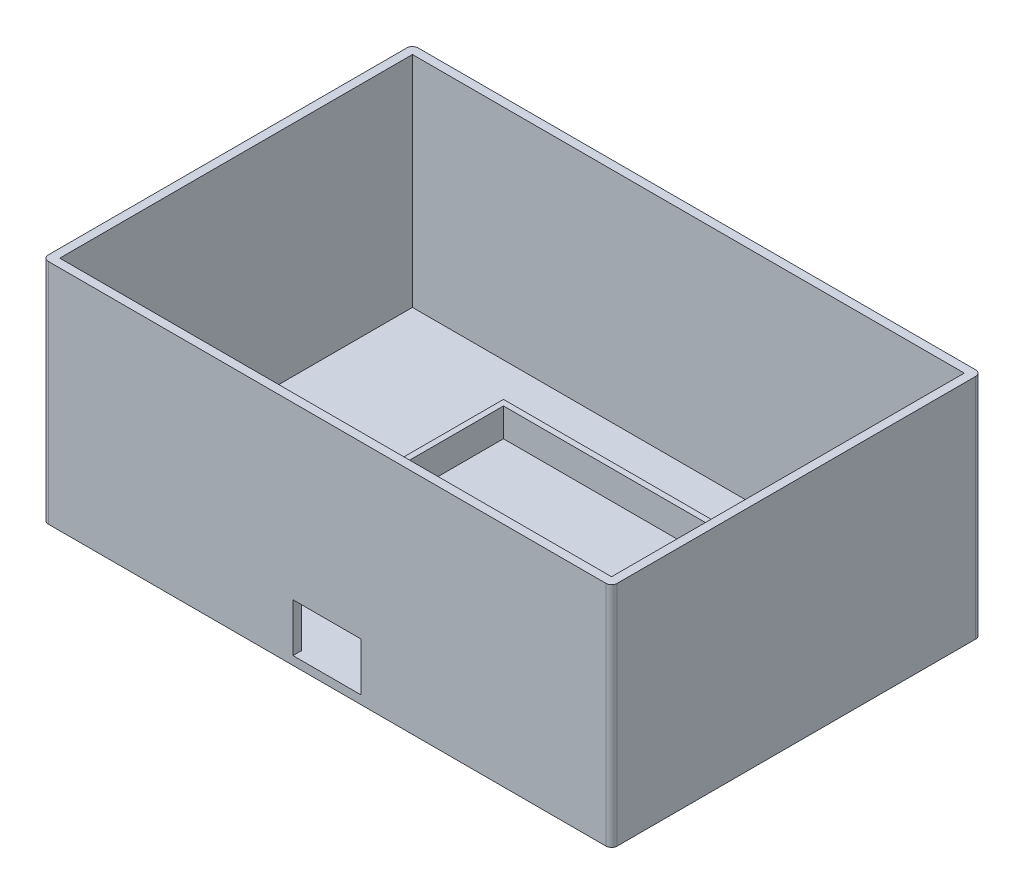
ISO-10303-21;
HEADER;
FILE_DESCRIPTION(('STEP AP214'),'2;1');
FILE_NAME('part.step','',(''),(''),'','','');
FILE_SCHEMA(('AUTOMOTIVE_DESIGN { 1 0 10303 214 1 1 1 1 }'));
ENDSEC;
DATA;
#1=APPLICATION_CONTEXT('core data for automotive mechanical design processes');
#2=APPLICATION_PROTOCOL_DEFINITION('international standard','automotive_design',2000,#1);
#3=PRODUCT_CONTEXT('',#1,'mechanical');
#4=PRODUCT('Part','Part','',(#3));
#5=PRODUCT_RELATED_PRODUCT_CATEGORY('part','',(#4));
#6=PRODUCT_DEFINITION_FORMATION('','',#4);
#7=PRODUCT_DEFINITION_CONTEXT('part definition',#1,'design');
#8=PRODUCT_DEFINITION('design','',#6,#7);
#9=PRODUCT_DEFINITION_SHAPE('','',#8);
#10=(LENGTH_UNIT() NAMED_UNIT(*) SI_UNIT(.MILLI.,.METRE.));
#11=(NAMED_UNIT(*) PLANE_ANGLE_UNIT() SI_UNIT($,.RADIAN.));
#12=(NAMED_UNIT(*) SI_UNIT($,.STERADIAN.) SOLID_ANGLE_UNIT());
#13=UNCERTAINTY_MEASURE_WITH_UNIT(LENGTH_MEASURE(1.E-05),#10,'distance_accuracy_value','');
#14=(GEOMETRIC_REPRESENTATION_CONTEXT(3) GLOBAL_UNCERTAINTY_ASSIGNED_CONTEXT((#13)) GLOBAL_UNIT_ASSIGNED_CONTEXT((#10,
#11,#12)) REPRESENTATION_CONTEXT('',''));
#15=CARTESIAN_POINT('',(0.,0.,0.));
#16=DIRECTION('',(0.,0.,1.));
#17=DIRECTION('',(1.,0.,0.));
#18=AXIS2_PLACEMENT_3D('',#15,#16,#17);
#19=CARTESIAN_POINT('',(0.,1.5,0.));
#20=DIRECTION('',(0.,1.,0.));
#21=DIRECTION('',(0.,0.,1.));
#22=AXIS2_PLACEMENT_3D('',#19,#20,#21);
#23=PLANE('',#22);
#24=DIRECTION('',(1.,0.,0.));
#25=VECTOR('',#24,1.);
#26=CARTESIAN_POINT('',(-47.2604562737643,1.5,20.6444866920152));
#27=LINE('',#26,#25);
#28=CARTESIAN_POINT('',(-47.2604562737643,1.5,20.6444866920152));
#29=VERTEX_POINT('',#28);
#30=CARTESIAN_POINT('',(-20.2604562737643,1.5,20.6444866920152));
#31=VERTEX_POINT('',#30);
#32=EDGE_CURVE('E288',#29,#31,#27,.T.);
#33=ORIENTED_EDGE('',*,*,#32,.T.);
#34=DIRECTION('',(0.,0.,1.));
#35=VECTOR('',#34,1.);
#36=CARTESIAN_POINT('',(-20.2604562737643,1.5,20.6444866920152));
#37=LINE('',#36,#35);
#38=CARTESIAN_POINT('',(-20.2604562737643,1.5,-30.3555133079848));
#39=VERTEX_POINT('',#38);
#40=EDGE_CURVE('E250',#39,#31,#37,.T.);
#41=ORIENTED_EDGE('',*,*,#40,.F.);
#42=DIRECTION('',(-1.,0.,0.));
#43=VECTOR('',#42,1.);
#44=CARTESIAN_POINT('',(-20.2604562737643,1.5,-30.3555133079848));
#45=LINE('',#44,#43);
#46=CARTESIAN_POINT('',(22.7395437262358,1.5,-30.3555133079848));
#47=VERTEX_POINT('',#46);
#48=EDGE_CURVE('E253',#47,#39,#45,.T.);
#49=ORIENTED_EDGE('',*,*,#48,.F.);
#50=DIRECTION('',(0.,0.,-1.));
#51=VECTOR('',#50,1.);
#52=CARTESIAN_POINT('',(22.7395437262358,1.5,20.6444866920152));
#53=LINE('',#52,#51);
#54=CARTESIAN_POINT('',(22.7395437262358,1.5,20.6444866920152));
#55=VERTEX_POINT('',#54);
#56=EDGE_CURVE('E262',#55,#47,#53,.T.);
#57=ORIENTED_EDGE('',*,*,#56,.F.);
#58=CARTESIAN_POINT('',(49.7395437262358,1.5,20.6444866920152));
#59=VERTEX_POINT('',#58);
#60=EDGE_CURVE('E286',#55,#59,#27,.T.);
#61=ORIENTED_EDGE('',*,*,#60,.T.);
#62=DIRECTION('',(0.,0.,-1.));
#63=VECTOR('',#62,1.);
#64=CARTESIAN_POINT('',(49.7395437262358,1.5,-41.3555133079848));
#65=LINE('',#64,#63);
#66=CARTESIAN_POINT('',(49.7395437262358,1.5,-41.3555133079848));
#67=VERTEX_POINT('',#66);
#68=EDGE_CURVE('E291',#59,#67,#65,.T.);
#69=ORIENTED_EDGE('',*,*,#68,.T.);
#70=DIRECTION('',(-1.,0.,0.));
#71=VECTOR('',#70,1.);
#72=CARTESIAN_POINT('',(-47.2604562737643,1.5,-41.3555133079848));
#73=LINE('',#72,#71);
#74=CARTESIAN_POINT('',(-47.2604562737643,1.5,-41.3555133079848));
#75=VERTEX_POINT('',#74);
#76=EDGE_CURVE('E294',#67,#75,#73,.T.);
#77=ORIENTED_EDGE('',*,*,#76,.T.);
#78=DIRECTION('',(0.,0.,1.));
#79=VECTOR('',#78,1.);
#80=CARTESIAN_POINT('',(-47.2604562737643,1.5,-41.3555133079848));
#81=LINE('',#80,#79);
#82=EDGE_CURVE('E283',#75,#29,#81,.T.);
#83=ORIENTED_EDGE('',*,*,#82,.T.);
#84=EDGE_LOOP('',(#33,#41,#49,#57,#61,#69,#77,#83));
#85=FACE_BOUND('',#84,.T.);
#86=ADVANCED_FACE('F32',(#85),#23,.T.);
#87=CARTESIAN_POINT('',(0.,40.,0.));
#88=DIRECTION('',(0.,1.,0.));
#89=DIRECTION('',(0.,0.,1.));
#90=AXIS2_PLACEMENT_3D('',#87,#88,#89);
#91=PLANE('',#90);
#92=DIRECTION('',(0.,0.,1.));
#93=VECTOR('',#92,1.);
#94=CARTESIAN_POINT('',(-47.2604562737643,40.,-41.3555133079848));
#95=LINE('',#94,#93);
#96=CARTESIAN_POINT('',(-47.2604562737643,40.,-41.3555133079848));
#97=VERTEX_POINT('',#96);
#98=CARTESIAN_POINT('',(-47.2604562737643,40.,20.6444866920152));
#99=VERTEX_POINT('',#98);
#100=EDGE_CURVE('E281',#97,#99,#95,.T.);
#101=ORIENTED_EDGE('',*,*,#100,.F.);
#102=DIRECTION('',(-1.,0.,0.));
#103=VECTOR('',#102,1.);
#104=CARTESIAN_POINT('',(-47.2604562737643,40.,-41.3555133079848));
#105=LINE('',#104,#103);
#106=CARTESIAN_POINT('',(49.7395437262358,40.,-41.3555133079848));
#107=VERTEX_POINT('',#106);
#108=EDGE_CURVE('E287',#107,#97,#105,.T.);
#109=ORIENTED_EDGE('',*,*,#108,.F.);
#110=DIRECTION('',(0.,0.,-1.));
#111=VECTOR('',#110,1.);
#112=CARTESIAN_POINT('',(49.7395437262358,40.,-41.3555133079848));
#113=LINE('',#112,#111);
#114=CARTESIAN_POINT('',(49.7395437262358,40.,20.6444866920152));
#115=VERTEX_POINT('',#114);
#116=EDGE_CURVE('E302',#115,#107,#113,.T.);
#117=ORIENTED_EDGE('',*,*,#116,.F.);
#118=DIRECTION('',(1.,0.,0.));
#119=VECTOR('',#118,1.);
#120=CARTESIAN_POINT('',(-47.2604562737643,40.,20.6444866920152));
#121=LINE('',#120,#119);
#122=EDGE_CURVE('E299',#99,#115,#121,.T.);
#123=ORIENTED_EDGE('',*,*,#122,.F.);
#124=EDGE_LOOP('',(#101,#109,#117,#123));
#125=FACE_BOUND('',#124,.T.);
#126=DIRECTION('',(-1.,0.,0.));
#127=VECTOR('',#126,1.);
#128=CARTESIAN_POINT('',(-48.7604562737643,40.,-42.8555133079848));
#129=LINE('',#128,#127);
#130=CARTESIAN_POINT('',(50.2395437262357,40.,-42.8555133079848));
#131=VERTEX_POINT('',#130);
#132=CARTESIAN_POINT('',(-47.7604562737643,40.,-42.8555133079848));
#133=VERTEX_POINT('',#132);
#134=EDGE_CURVE('E309',#131,#133,#129,.T.);
#135=ORIENTED_EDGE('',*,*,#134,.T.);
#136=CARTESIAN_POINT('',(-47.7604562737643,40.,-41.8555133079848));
#137=DIRECTION('',(0.,1.,0.));
#138=DIRECTION('',(0.,0.,1.));
#139=AXIS2_PLACEMENT_3D('',#136,#137,#138);
#140=CIRCLE('',#139,1.);
#141=CARTESIAN_POINT('',(-48.7604562737643,40.,-41.8555133079848));
#142=VERTEX_POINT('',#141);
#143=EDGE_CURVE('E370',#133,#142,#140,.T.);
#144=ORIENTED_EDGE('',*,*,#143,.T.);
#145=DIRECTION('',(0.,0.,1.));
#146=VECTOR('',#145,1.);
#147=CARTESIAN_POINT('',(-48.7604562737643,40.,-42.8555133079848));
#148=LINE('',#147,#146);
#149=CARTESIAN_POINT('',(-48.7604562737643,40.,21.1444866920152));
#150=VERTEX_POINT('',#149);
#151=EDGE_CURVE('E320',#142,#150,#148,.T.);
#152=ORIENTED_EDGE('',*,*,#151,.T.);
#153=CARTESIAN_POINT('',(-47.7604562737643,40.,21.1444866920152));
#154=DIRECTION('',(0.,1.,0.));
#155=DIRECTION('',(0.,0.,1.));
#156=AXIS2_PLACEMENT_3D('',#153,#154,#155);
#157=CIRCLE('',#156,1.);
#158=CARTESIAN_POINT('',(-47.7604562737643,40.,22.1444866920152));
#159=VERTEX_POINT('',#158);
#160=EDGE_CURVE('E364',#150,#159,#157,.T.);
#161=ORIENTED_EDGE('',*,*,#160,.T.);
#162=DIRECTION('',(1.,0.,0.));
#163=VECTOR('',#162,1.);
#164=CARTESIAN_POINT('',(-48.7604562737643,40.,22.1444866920152));
#165=LINE('',#164,#163);
#166=CARTESIAN_POINT('',(50.2395437262358,40.,22.1444866920152));
#167=VERTEX_POINT('',#166);
#168=EDGE_CURVE('E332',#159,#167,#165,.T.);
#169=ORIENTED_EDGE('',*,*,#168,.T.);
#170=CARTESIAN_POINT('',(50.2395437262358,40.,21.1444866920152));
#171=DIRECTION('',(0.,1.,0.));
#172=DIRECTION('',(0.,0.,1.));
#173=AXIS2_PLACEMENT_3D('',#170,#171,#172);
#174=CIRCLE('',#173,1.);
#175=CARTESIAN_POINT('',(51.2395437262358,40.,21.1444866920152));
#176=VERTEX_POINT('',#175);
#177=EDGE_CURVE('E366',#167,#176,#174,.T.);
#178=ORIENTED_EDGE('',*,*,#177,.T.);
#179=DIRECTION('',(0.,0.,-1.));
#180=VECTOR('',#179,1.);
#181=CARTESIAN_POINT('',(51.2395437262357,40.,-42.8555133079848));
#182=LINE('',#181,#180);
#183=CARTESIAN_POINT('',(51.2395437262357,40.,-41.8555133079848));
#184=VERTEX_POINT('',#183);
#185=EDGE_CURVE('E335',#176,#184,#182,.T.);
#186=ORIENTED_EDGE('',*,*,#185,.T.);
#187=CARTESIAN_POINT('',(50.2395437262357,40.,-41.8555133079848));
#188=DIRECTION('',(0.,1.,0.));
#189=DIRECTION('',(0.,0.,1.));
#190=AXIS2_PLACEMENT_3D('',#187,#188,#189);
#191=CIRCLE('',#190,1.);
#192=EDGE_CURVE('E368',#184,#131,#191,.T.);
#193=ORIENTED_EDGE('',*,*,#192,.T.);
#194=EDGE_LOOP('',(#135,#144,#152,#161,#169,#178,#186,#193));
#195=FACE_BOUND('',#194,.T.);
#196=ADVANCED_FACE('F397',(#125,#195),#91,.T.);
#197=CARTESIAN_POINT('',(-48.7604562737643,80.,-42.8555133079848));
#198=DIRECTION('',(1.,0.,0.));
#199=DIRECTION('',(0.,0.,-1.));
#200=AXIS2_PLACEMENT_3D('',#197,#198,#199);
#201=PLANE('',#200);
#202=ORIENTED_EDGE('',*,*,#151,.F.);
#203=DIRECTION('',(0.,-1.,0.));
#204=VECTOR('',#203,1.);
#205=CARTESIAN_POINT('',(-48.7604562737643,80.,-41.8555133079848));
#206=LINE('',#205,#204);
#207=CARTESIAN_POINT('',(-48.7604562737643,0.,-41.8555133079848));
#208=VERTEX_POINT('',#207);
#209=EDGE_CURVE('E348',#142,#208,#206,.T.);
#210=ORIENTED_EDGE('',*,*,#209,.T.);
#211=DIRECTION('',(0.,0.,1.));
#212=VECTOR('',#211,1.);
#213=CARTESIAN_POINT('',(-48.7604562737643,0.,-42.8555133079848));
#214=LINE('',#213,#212);
#215=CARTESIAN_POINT('',(-48.7604562737643,0.,21.1444866920152));
#216=VERTEX_POINT('',#215);
#217=EDGE_CURVE('E326',#208,#216,#214,.T.);
#218=ORIENTED_EDGE('',*,*,#217,.T.);
#219=DIRECTION('',(0.,-1.,0.));
#220=VECTOR('',#219,1.);
#221=CARTESIAN_POINT('',(-48.7604562737643,80.,21.1444866920152));
#222=LINE('',#221,#220);
#223=EDGE_CURVE('E346',#216,#150,#222,.F.);
#224=ORIENTED_EDGE('',*,*,#223,.T.);
#225=EDGE_LOOP('',(#202,#210,#218,#224));
#226=FACE_BOUND('',#225,.T.);
#227=ADVANCED_FACE('F412',(#226),#201,.F.);
#228=CARTESIAN_POINT('',(-48.7604562737643,80.,22.1444866920152));
#229=DIRECTION('',(0.,0.,-1.));
#230=DIRECTION('',(-1.,0.,0.));
#231=AXIS2_PLACEMENT_3D('',#228,#229,#230);
#232=PLANE('',#231);
#233=DIRECTION('',(1.,0.,0.));
#234=VECTOR('',#233,1.);
#235=CARTESIAN_POINT('',(-4.76045627376426,1.5,22.1444866920152));
#236=LINE('',#235,#234);
#237=CARTESIAN_POINT('',(-4.76045627376426,1.5,22.1444866920152));
#238=VERTEX_POINT('',#237);
#239=CARTESIAN_POINT('',(7.23954372623574,1.5,22.1444866920152));
#240=VERTEX_POINT('',#239);
#241=EDGE_CURVE('E211',#238,#240,#236,.T.);
#242=ORIENTED_EDGE('',*,*,#241,.F.);
#243=DIRECTION('',(0.,-1.,0.));
#244=VECTOR('',#243,1.);
#245=CARTESIAN_POINT('',(-4.76045627376426,2.,22.1444866920152));
#246=LINE('',#245,#244);
#247=CARTESIAN_POINT('',(-4.76045627376426,10.,22.1444866920152));
#248=VERTEX_POINT('',#247);
#249=EDGE_CURVE('E193',#248,#238,#246,.T.);
#250=ORIENTED_EDGE('',*,*,#249,.F.);
#251=DIRECTION('',(-1.,0.,0.));
#252=VECTOR('',#251,1.);
#253=CARTESIAN_POINT('',(-4.76045627376426,10.,22.1444866920152));
#254=LINE('',#253,#252);
#255=CARTESIAN_POINT('',(7.23954372623574,10.,22.1444866920152));
#256=VERTEX_POINT('',#255);
#257=EDGE_CURVE('E277',#256,#248,#254,.T.);
#258=ORIENTED_EDGE('',*,*,#257,.F.);
#259=DIRECTION('',(0.,1.,0.));
#260=VECTOR('',#259,1.);
#261=CARTESIAN_POINT('',(7.23954372623574,2.,22.1444866920152));
#262=LINE('',#261,#260);
#263=EDGE_CURVE('E204',#240,#256,#262,.T.);
#264=ORIENTED_EDGE('',*,*,#263,.F.);
#265=EDGE_LOOP('',(#242,#250,#258,#264));
#266=FACE_BOUND('',#265,.T.);
#267=DIRECTION('',(1.,0.,0.));
#268=VECTOR('',#267,1.);
#269=CARTESIAN_POINT('',(-48.7604562737643,0.,22.1444866920152));
#270=LINE('',#269,#268);
#271=CARTESIAN_POINT('',(-47.7604562737643,0.,22.1444866920152));
#272=VERTEX_POINT('',#271);
#273=CARTESIAN_POINT('',(50.2395437262358,0.,22.1444866920152));
#274=VERTEX_POINT('',#273);
#275=EDGE_CURVE('E323',#272,#274,#270,.T.);
#276=ORIENTED_EDGE('',*,*,#275,.T.);
#277=DIRECTION('',(0.,-1.,0.));
#278=VECTOR('',#277,1.);
#279=CARTESIAN_POINT('',(50.2395437262358,80.,22.1444866920152));
#280=LINE('',#279,#278);
#281=EDGE_CURVE('E11',#274,#167,#280,.F.);
#282=ORIENTED_EDGE('',*,*,#281,.T.);
#283=ORIENTED_EDGE('',*,*,#168,.F.);
#284=DIRECTION('',(0.,-1.,0.));
#285=VECTOR('',#284,1.);
#286=CARTESIAN_POINT('',(-47.7604562737643,80.,22.1444866920152));
#287=LINE('',#286,#285);
#288=EDGE_CURVE('E40',#159,#272,#287,.T.);
#289=ORIENTED_EDGE('',*,*,#288,.T.);
#290=EDGE_LOOP('',(#276,#282,#283,#289));
#291=FACE_BOUND('',#290,.T.);
#292=ADVANCED_FACE('F216',(#266,#291),#232,.F.);
#293=CARTESIAN_POINT('',(51.2395437262357,80.,-42.8555133079848));
#294=DIRECTION('',(-1.,0.,0.));
#295=DIRECTION('',(0.,0.,1.));
#296=AXIS2_PLACEMENT_3D('',#293,#294,#295);
#297=PLANE('',#296);
#298=DIRECTION('',(0.,0.,-1.));
#299=VECTOR('',#298,1.);
#300=CARTESIAN_POINT('',(51.2395437262357,0.,-42.8555133079848));
#301=LINE('',#300,#299);
#302=CARTESIAN_POINT('',(51.2395437262358,0.,21.1444866920152));
#303=VERTEX_POINT('',#302);
#304=CARTESIAN_POINT('',(51.2395437262357,0.,-41.8555133079848));
#305=VERTEX_POINT('',#304);
#306=EDGE_CURVE('E319',#303,#305,#301,.T.);
#307=ORIENTED_EDGE('',*,*,#306,.T.);
#308=DIRECTION('',(0.,-1.,0.));
#309=VECTOR('',#308,1.);
#310=CARTESIAN_POINT('',(51.2395437262357,80.,-41.8555133079848));
#311=LINE('',#310,#309);
#312=EDGE_CURVE('E375',#305,#184,#311,.F.);
#313=ORIENTED_EDGE('',*,*,#312,.T.);
#314=ORIENTED_EDGE('',*,*,#185,.F.);
#315=DIRECTION('',(0.,-1.,0.));
#316=VECTOR('',#315,1.);
#317=CARTESIAN_POINT('',(51.2395437262358,80.,21.1444866920152));
#318=LINE('',#317,#316);
#319=EDGE_CURVE('E372',#176,#303,#318,.T.);
#320=ORIENTED_EDGE('',*,*,#319,.T.);
#321=EDGE_LOOP('',(#307,#313,#314,#320));
#322=FACE_BOUND('',#321,.T.);
#323=ADVANCED_FACE('F393',(#322),#297,.F.);
#324=CARTESIAN_POINT('',(-48.7604562737643,80.,-42.8555133079848));
#325=DIRECTION('',(0.,0.,1.));
#326=DIRECTION('',(1.,0.,0.));
#327=AXIS2_PLACEMENT_3D('',#324,#325,#326);
#328=PLANE('',#327);
#329=DIRECTION('',(-1.,0.,0.));
#330=VECTOR('',#329,1.);
#331=CARTESIAN_POINT('',(-48.7604562737643,0.,-42.8555133079848));
#332=LINE('',#331,#330);
#333=CARTESIAN_POINT('',(50.2395437262357,0.,-42.8555133079848));
#334=VERTEX_POINT('',#333);
#335=CARTESIAN_POINT('',(-47.7604562737643,0.,-42.8555133079848));
#336=VERTEX_POINT('',#335);
#337=EDGE_CURVE('E316',#334,#336,#332,.T.);
#338=ORIENTED_EDGE('',*,*,#337,.T.);
#339=DIRECTION('',(0.,-1.,0.));
#340=VECTOR('',#339,1.);
#341=CARTESIAN_POINT('',(-47.7604562737643,80.,-42.8555133079848));
#342=LINE('',#341,#340);
#343=EDGE_CURVE('E362',#336,#133,#342,.F.);
#344=ORIENTED_EDGE('',*,*,#343,.T.);
#345=ORIENTED_EDGE('',*,*,#134,.F.);
#346=DIRECTION('',(0.,-1.,0.));
#347=VECTOR('',#346,1.);
#348=CARTESIAN_POINT('',(50.2395437262357,80.,-42.8555133079848));
#349=LINE('',#348,#347);
#350=EDGE_CURVE('E359',#131,#334,#349,.T.);
#351=ORIENTED_EDGE('',*,*,#350,.T.);
#352=EDGE_LOOP('',(#338,#344,#345,#351));
#353=FACE_BOUND('',#352,.T.);
#354=ADVANCED_FACE('F404',(#353),#328,.F.);
#355=CARTESIAN_POINT('',(0.,0.,0.));
#356=DIRECTION('',(0.,1.,0.));
#357=DIRECTION('',(0.,0.,1.));
#358=AXIS2_PLACEMENT_3D('',#355,#356,#357);
#359=PLANE('',#358);
#360=ORIENTED_EDGE('',*,*,#217,.F.);
#361=CARTESIAN_POINT('',(-47.7604562737643,0.,-41.8555133079848));
#362=DIRECTION('',(0.,1.,0.));
#363=DIRECTION('',(0.,0.,1.));
#364=AXIS2_PLACEMENT_3D('',#361,#362,#363);
#365=CIRCLE('',#364,1.);
#366=EDGE_CURVE('E357',#208,#336,#365,.F.);
#367=ORIENTED_EDGE('',*,*,#366,.T.);
#368=ORIENTED_EDGE('',*,*,#337,.F.);
#369=CARTESIAN_POINT('',(50.2395437262357,0.,-41.8555133079848));
#370=DIRECTION('',(0.,1.,0.));
#371=DIRECTION('',(0.,0.,1.));
#372=AXIS2_PLACEMENT_3D('',#369,#370,#371);
#373=CIRCLE('',#372,1.);
#374=EDGE_CURVE('E355',#334,#305,#373,.F.);
#375=ORIENTED_EDGE('',*,*,#374,.T.);
#376=ORIENTED_EDGE('',*,*,#306,.F.);
#377=CARTESIAN_POINT('',(50.2395437262358,0.,21.1444866920152));
#378=DIRECTION('',(0.,1.,0.));
#379=DIRECTION('',(0.,0.,1.));
#380=AXIS2_PLACEMENT_3D('',#377,#378,#379);
#381=CIRCLE('',#380,1.);
#382=EDGE_CURVE('E353',#303,#274,#381,.F.);
#383=ORIENTED_EDGE('',*,*,#382,.T.);
#384=ORIENTED_EDGE('',*,*,#275,.F.);
#385=CARTESIAN_POINT('',(-47.7604562737643,0.,21.1444866920152));
#386=DIRECTION('',(0.,1.,0.));
#387=DIRECTION('',(0.,0.,1.));
#388=AXIS2_PLACEMENT_3D('',#385,#386,#387);
#389=CIRCLE('',#388,1.);
#390=EDGE_CURVE('E351',#272,#216,#389,.F.);
#391=ORIENTED_EDGE('',*,*,#390,.T.);
#392=EDGE_LOOP('',(#360,#367,#368,#375,#376,#383,#384,#391));
#393=FACE_BOUND('',#392,.T.);
#394=ADVANCED_FACE('F385',(#393),#359,.F.);
#395=CARTESIAN_POINT('',(-47.2604562737643,1.5,-41.3555133079848));
#396=DIRECTION('',(-1.,0.,0.));
#397=DIRECTION('',(0.,0.,1.));
#398=AXIS2_PLACEMENT_3D('',#395,#396,#397);
#399=PLANE('',#398);
#400=ORIENTED_EDGE('',*,*,#100,.T.);
#401=DIRECTION('',(0.,1.,0.));
#402=VECTOR('',#401,1.);
#403=CARTESIAN_POINT('',(-47.2604562737643,1.5,20.6444866920152));
#404=LINE('',#403,#402);
#405=EDGE_CURVE('E297',#29,#99,#404,.T.);
#406=ORIENTED_EDGE('',*,*,#405,.F.);
#407=ORIENTED_EDGE('',*,*,#82,.F.);
#408=DIRECTION('',(0.,1.,0.));
#409=VECTOR('',#408,1.);
#410=CARTESIAN_POINT('',(-47.2604562737643,1.5,-41.3555133079848));
#411=LINE('',#410,#409);
#412=EDGE_CURVE('E307',#75,#97,#411,.T.);
#413=ORIENTED_EDGE('',*,*,#412,.T.);
#414=EDGE_LOOP('',(#400,#406,#407,#413));
#415=FACE_BOUND('',#414,.T.);
#416=ADVANCED_FACE('F430',(#415),#399,.F.);
#417=CARTESIAN_POINT('',(-47.2604562737643,1.5,-41.3555133079848));
#418=DIRECTION('',(0.,0.,-1.));
#419=DIRECTION('',(-1.,0.,0.));
#420=AXIS2_PLACEMENT_3D('',#417,#418,#419);
#421=PLANE('',#420);
#422=ORIENTED_EDGE('',*,*,#108,.T.);
#423=ORIENTED_EDGE('',*,*,#412,.F.);
#424=ORIENTED_EDGE('',*,*,#76,.F.);
#425=DIRECTION('',(0.,1.,0.));
#426=VECTOR('',#425,1.);
#427=CARTESIAN_POINT('',(49.7395437262358,1.5,-41.3555133079848));
#428=LINE('',#427,#426);
#429=EDGE_CURVE('E310',#67,#107,#428,.T.);
#430=ORIENTED_EDGE('',*,*,#429,.T.);
#431=EDGE_LOOP('',(#422,#423,#424,#430));
#432=FACE_BOUND('',#431,.T.);
#433=ADVANCED_FACE('F621',(#432),#421,.F.);
#434=CARTESIAN_POINT('',(49.7395437262358,1.5,-41.3555133079848));
#435=DIRECTION('',(1.,0.,0.));
#436=DIRECTION('',(0.,0.,-1.));
#437=AXIS2_PLACEMENT_3D('',#434,#435,#436);
#438=PLANE('',#437);
#439=ORIENTED_EDGE('',*,*,#116,.T.);
#440=ORIENTED_EDGE('',*,*,#429,.F.);
#441=ORIENTED_EDGE('',*,*,#68,.F.);
#442=DIRECTION('',(0.,1.,0.));
#443=VECTOR('',#442,1.);
#444=CARTESIAN_POINT('',(49.7395437262358,1.5,20.6444866920152));
#445=LINE('',#444,#443);
#446=EDGE_CURVE('E312',#59,#115,#445,.T.);
#447=ORIENTED_EDGE('',*,*,#446,.T.);
#448=EDGE_LOOP('',(#439,#440,#441,#447));
#449=FACE_BOUND('',#448,.T.);
#450=ADVANCED_FACE('F613',(#449),#438,.F.);
#451=CARTESIAN_POINT('',(-47.2604562737643,1.5,20.6444866920152));
#452=DIRECTION('',(0.,0.,1.));
#453=DIRECTION('',(1.,0.,0.));
#454=AXIS2_PLACEMENT_3D('',#451,#452,#453);
#455=PLANE('',#454);
#456=DIRECTION('',(0.,-1.,0.));
#457=VECTOR('',#456,1.);
#458=CARTESIAN_POINT('',(-4.76045627376426,1.5,20.6444866920152));
#459=LINE('',#458,#457);
#460=CARTESIAN_POINT('',(-4.76045627376426,10.,20.6444866920152));
#461=VERTEX_POINT('',#460);
#462=CARTESIAN_POINT('',(-4.76045627376426,1.5,20.6444866920152));
#463=VERTEX_POINT('',#462);
#464=EDGE_CURVE('E344',#461,#463,#459,.T.);
#465=ORIENTED_EDGE('',*,*,#464,.T.);
#466=DIRECTION('',(-1.,0.,0.));
#467=VECTOR('',#466,1.);
#468=CARTESIAN_POINT('',(21.7395437262358,1.5,20.6444866920152));
#469=LINE('',#468,#467);
#470=CARTESIAN_POINT('',(-19.2604562737643,1.5,20.6444866920152));
#471=VERTEX_POINT('',#470);
#472=EDGE_CURVE('E213',#463,#471,#469,.T.);
#473=ORIENTED_EDGE('',*,*,#472,.T.);
#474=DIRECTION('',(0.,1.,0.));
#475=VECTOR('',#474,1.);
#476=CARTESIAN_POINT('',(-19.2604562737643,1.5,20.6444866920152));
#477=LINE('',#476,#475);
#478=CARTESIAN_POINT('',(-19.2604562737643,6.5,20.6444866920152));
#479=VERTEX_POINT('',#478);
#480=EDGE_CURVE('E229',#471,#479,#477,.T.);
#481=ORIENTED_EDGE('',*,*,#480,.T.);
#482=DIRECTION('',(1.,0.,0.));
#483=VECTOR('',#482,1.);
#484=CARTESIAN_POINT('',(-20.2604562737643,6.5,20.6444866920152));
#485=LINE('',#484,#483);
#486=CARTESIAN_POINT('',(-20.2604562737643,6.5,20.6444866920152));
#487=VERTEX_POINT('',#486);
#488=EDGE_CURVE('E47',#487,#479,#485,.T.);
#489=ORIENTED_EDGE('',*,*,#488,.F.);
#490=DIRECTION('',(0.,-1.,0.));
#491=VECTOR('',#490,1.);
#492=CARTESIAN_POINT('',(-20.2604562737643,6.5,20.6444866920152));
#493=LINE('',#492,#491);
#494=EDGE_CURVE('E205',#487,#31,#493,.T.);
#495=ORIENTED_EDGE('',*,*,#494,.T.);
#496=ORIENTED_EDGE('',*,*,#32,.F.);
#497=ORIENTED_EDGE('',*,*,#405,.T.);
#498=ORIENTED_EDGE('',*,*,#122,.T.);
#499=ORIENTED_EDGE('',*,*,#446,.F.);
#500=ORIENTED_EDGE('',*,*,#60,.F.);
#501=DIRECTION('',(0.,-1.,0.));
#502=VECTOR('',#501,1.);
#503=CARTESIAN_POINT('',(22.7395437262358,6.5,20.6444866920152));
#504=LINE('',#503,#502);
#505=CARTESIAN_POINT('',(22.7395437262358,6.5,20.6444866920152));
#506=VERTEX_POINT('',#505);
#507=EDGE_CURVE('E272',#506,#55,#504,.T.);
#508=ORIENTED_EDGE('',*,*,#507,.F.);
#509=CARTESIAN_POINT('',(21.7395437262358,6.5,20.6444866920152));
#510=VERTEX_POINT('',#509);
#511=EDGE_CURVE('E55',#510,#506,#485,.T.);
#512=ORIENTED_EDGE('',*,*,#511,.F.);
#513=DIRECTION('',(0.,-1.,0.));
#514=VECTOR('',#513,1.);
#515=CARTESIAN_POINT('',(21.7395437262358,1.5,20.6444866920152));
#516=LINE('',#515,#514);
#517=CARTESIAN_POINT('',(21.7395437262358,1.5,20.6444866920152));
#518=VERTEX_POINT('',#517);
#519=EDGE_CURVE('E222',#510,#518,#516,.T.);
#520=ORIENTED_EDGE('',*,*,#519,.T.);
#521=CARTESIAN_POINT('',(7.23954372623574,1.5,20.6444866920152));
#522=VERTEX_POINT('',#521);
#523=EDGE_CURVE('E226',#518,#522,#469,.T.);
#524=ORIENTED_EDGE('',*,*,#523,.T.);
#525=DIRECTION('',(0.,1.,0.));
#526=VECTOR('',#525,1.);
#527=CARTESIAN_POINT('',(7.23954372623574,1.5,20.6444866920152));
#528=LINE('',#527,#526);
#529=CARTESIAN_POINT('',(7.23954372623574,10.,20.6444866920152));
#530=VERTEX_POINT('',#529);
#531=EDGE_CURVE('E329',#522,#530,#528,.T.);
#532=ORIENTED_EDGE('',*,*,#531,.T.);
#533=DIRECTION('',(-1.,0.,0.));
#534=VECTOR('',#533,1.);
#535=CARTESIAN_POINT('',(-47.2604562737643,10.,20.6444866920152));
#536=LINE('',#535,#534);
#537=EDGE_CURVE('E341',#530,#461,#536,.T.);
#538=ORIENTED_EDGE('',*,*,#537,.T.);
#539=EDGE_LOOP('',(#465,#473,#481,#489,#495,#496,#497,#498,#499,#500,#508,#512,#520,#524,#532,#538));
#540=FACE_BOUND('',#539,.T.);
#541=ADVANCED_FACE('F605',(#540),#455,.F.);
#542=CARTESIAN_POINT('',(-4.76045627376426,2.,17.1444866920152));
#543=DIRECTION('',(-1.,0.,0.));
#544=DIRECTION('',(0.,0.,1.));
#545=AXIS2_PLACEMENT_3D('',#542,#543,#544);
#546=PLANE('',#545);
#547=DIRECTION('',(0.,0.,1.));
#548=VECTOR('',#547,1.);
#549=CARTESIAN_POINT('',(-4.76045627376426,10.,17.1444866920152));
#550=LINE('',#549,#548);
#551=EDGE_CURVE('E199',#461,#248,#550,.T.);
#552=ORIENTED_EDGE('',*,*,#551,.T.);
#553=ORIENTED_EDGE('',*,*,#249,.T.);
#554=DIRECTION('',(0.,0.,1.));
#555=VECTOR('',#554,1.);
#556=CARTESIAN_POINT('',(-4.76045627376426,1.5,-8.85551330798478));
#557=LINE('',#556,#555);
#558=EDGE_CURVE('E196',#463,#238,#557,.T.);
#559=ORIENTED_EDGE('',*,*,#558,.F.);
#560=ORIENTED_EDGE('',*,*,#464,.F.);
#561=EDGE_LOOP('',(#552,#553,#559,#560));
#562=FACE_BOUND('',#561,.T.);
#563=ADVANCED_FACE('F195',(#562),#546,.F.);
#564=CARTESIAN_POINT('',(-4.76045627376426,10.,17.1444866920152));
#565=DIRECTION('',(0.,1.,0.));
#566=DIRECTION('',(0.,0.,1.));
#567=AXIS2_PLACEMENT_3D('',#564,#565,#566);
#568=PLANE('',#567);
#569=DIRECTION('',(0.,0.,1.));
#570=VECTOR('',#569,1.);
#571=CARTESIAN_POINT('',(7.23954372623574,10.,17.1444866920152));
#572=LINE('',#571,#570);
#573=EDGE_CURVE('E279',#530,#256,#572,.T.);
#574=ORIENTED_EDGE('',*,*,#573,.T.);
#575=ORIENTED_EDGE('',*,*,#257,.T.);
#576=ORIENTED_EDGE('',*,*,#551,.F.);
#577=ORIENTED_EDGE('',*,*,#537,.F.);
#578=EDGE_LOOP('',(#574,#575,#576,#577));
#579=FACE_BOUND('',#578,.T.);
#580=ADVANCED_FACE('F586',(#579),#568,.F.);
#581=CARTESIAN_POINT('',(7.23954372623574,2.,17.1444866920152));
#582=DIRECTION('',(1.,0.,0.));
#583=DIRECTION('',(0.,0.,-1.));
#584=AXIS2_PLACEMENT_3D('',#581,#582,#583);
#585=PLANE('',#584);
#586=ORIENTED_EDGE('',*,*,#531,.F.);
#587=DIRECTION('',(0.,0.,1.));
#588=VECTOR('',#587,1.);
#589=CARTESIAN_POINT('',(7.23954372623574,1.5,-8.85551330798478));
#590=LINE('',#589,#588);
#591=EDGE_CURVE('E214',#522,#240,#590,.T.);
#592=ORIENTED_EDGE('',*,*,#591,.T.);
#593=ORIENTED_EDGE('',*,*,#263,.T.);
#594=ORIENTED_EDGE('',*,*,#573,.F.);
#595=EDGE_LOOP('',(#586,#592,#593,#594));
#596=FACE_BOUND('',#595,.T.);
#597=ADVANCED_FACE('F447',(#596),#585,.F.);
#598=CARTESIAN_POINT('',(-47.7604562737643,80.,-41.8555133079848));
#599=DIRECTION('',(0.,-1.,0.));
#600=DIRECTION('',(0.,0.,-1.));
#601=AXIS2_PLACEMENT_3D('',#598,#599,#600);
#602=CYLINDRICAL_SURFACE('',#601,1.);
#603=ORIENTED_EDGE('',*,*,#143,.F.);
#604=ORIENTED_EDGE('',*,*,#343,.F.);
#605=ORIENTED_EDGE('',*,*,#366,.F.);
#606=ORIENTED_EDGE('',*,*,#209,.F.);
#607=EDGE_LOOP('',(#603,#604,#605,#606));
#608=FACE_BOUND('',#607,.T.);
#609=ADVANCED_FACE('F409',(#608),#602,.T.);
#610=CARTESIAN_POINT('',(50.2395437262357,80.,-41.8555133079848));
#611=DIRECTION('',(0.,-1.,0.));
#612=DIRECTION('',(0.,0.,-1.));
#613=AXIS2_PLACEMENT_3D('',#610,#611,#612);
#614=CYLINDRICAL_SURFACE('',#613,1.);
#615=ORIENTED_EDGE('',*,*,#192,.F.);
#616=ORIENTED_EDGE('',*,*,#312,.F.);
#617=ORIENTED_EDGE('',*,*,#374,.F.);
#618=ORIENTED_EDGE('',*,*,#350,.F.);
#619=EDGE_LOOP('',(#615,#616,#617,#618));
#620=FACE_BOUND('',#619,.T.);
#621=ADVANCED_FACE('F401',(#620),#614,.T.);
#622=CARTESIAN_POINT('',(50.2395437262358,80.,21.1444866920152));
#623=DIRECTION('',(0.,-1.,0.));
#624=DIRECTION('',(0.,0.,-1.));
#625=AXIS2_PLACEMENT_3D('',#622,#623,#624);
#626=CYLINDRICAL_SURFACE('',#625,1.);
#627=ORIENTED_EDGE('',*,*,#177,.F.);
#628=ORIENTED_EDGE('',*,*,#281,.F.);
#629=ORIENTED_EDGE('',*,*,#382,.F.);
#630=ORIENTED_EDGE('',*,*,#319,.F.);
#631=EDGE_LOOP('',(#627,#628,#629,#630));
#632=FACE_BOUND('',#631,.T.);
#633=ADVANCED_FACE('F390',(#632),#626,.T.);
#634=CARTESIAN_POINT('',(-47.7604562737643,80.,21.1444866920152));
#635=DIRECTION('',(0.,-1.,0.));
#636=DIRECTION('',(0.,0.,-1.));
#637=AXIS2_PLACEMENT_3D('',#634,#635,#636);
#638=CYLINDRICAL_SURFACE('',#637,1.);
#639=ORIENTED_EDGE('',*,*,#160,.F.);
#640=ORIENTED_EDGE('',*,*,#223,.F.);
#641=ORIENTED_EDGE('',*,*,#390,.F.);
#642=ORIENTED_EDGE('',*,*,#288,.F.);
#643=EDGE_LOOP('',(#639,#640,#641,#642));
#644=FACE_BOUND('',#643,.T.);
#645=ADVANCED_FACE('F34',(#644),#638,.T.);
#646=CARTESIAN_POINT('',(0.,6.5,0.));
#647=DIRECTION('',(0.,1.,0.));
#648=DIRECTION('',(0.,0.,1.));
#649=AXIS2_PLACEMENT_3D('',#646,#647,#648);
#650=PLANE('',#649);
#651=DIRECTION('',(0.,0.,-1.));
#652=VECTOR('',#651,1.);
#653=CARTESIAN_POINT('',(21.7395437262358,6.5,0.));
#654=LINE('',#653,#652);
#655=CARTESIAN_POINT('',(21.7395437262358,6.5,-29.3555133079848));
#656=VERTEX_POINT('',#655);
#657=EDGE_CURVE('E234',#510,#656,#654,.T.);
#658=ORIENTED_EDGE('',*,*,#657,.F.);
#659=ORIENTED_EDGE('',*,*,#511,.T.);
#660=DIRECTION('',(0.,0.,-1.));
#661=VECTOR('',#660,1.);
#662=CARTESIAN_POINT('',(22.7395437262358,6.5,20.6444866920152));
#663=LINE('',#662,#661);
#664=CARTESIAN_POINT('',(22.7395437262358,6.5,-30.3555133079848));
#665=VERTEX_POINT('',#664);
#666=EDGE_CURVE('E255',#506,#665,#663,.T.);
#667=ORIENTED_EDGE('',*,*,#666,.T.);
#668=DIRECTION('',(-1.,0.,0.));
#669=VECTOR('',#668,1.);
#670=CARTESIAN_POINT('',(-20.2604562737643,6.5,-30.3555133079848));
#671=LINE('',#670,#669);
#672=CARTESIAN_POINT('',(-20.2604562737643,6.5,-30.3555133079848));
#673=VERTEX_POINT('',#672);
#674=EDGE_CURVE('E257',#665,#673,#671,.T.);
#675=ORIENTED_EDGE('',*,*,#674,.T.);
#676=DIRECTION('',(0.,0.,1.));
#677=VECTOR('',#676,1.);
#678=CARTESIAN_POINT('',(-20.2604562737643,6.5,20.6444866920152));
#679=LINE('',#678,#677);
#680=EDGE_CURVE('E251',#673,#487,#679,.T.);
#681=ORIENTED_EDGE('',*,*,#680,.T.);
#682=ORIENTED_EDGE('',*,*,#488,.T.);
#683=DIRECTION('',(0.,0.,1.));
#684=VECTOR('',#683,1.);
#685=CARTESIAN_POINT('',(-19.2604562737643,6.5,0.));
#686=LINE('',#685,#684);
#687=CARTESIAN_POINT('',(-19.2604562737643,6.5,-29.3555133079848));
#688=VERTEX_POINT('',#687);
#689=EDGE_CURVE('E232',#688,#479,#686,.T.);
#690=ORIENTED_EDGE('',*,*,#689,.F.);
#691=DIRECTION('',(-1.,0.,0.));
#692=VECTOR('',#691,1.);
#693=CARTESIAN_POINT('',(0.,6.5,-29.3555133079848));
#694=LINE('',#693,#692);
#695=EDGE_CURVE('E238',#656,#688,#694,.T.);
#696=ORIENTED_EDGE('',*,*,#695,.F.);
#697=EDGE_LOOP('',(#658,#659,#667,#675,#681,#682,#690,#696));
#698=FACE_BOUND('',#697,.T.);
#699=ADVANCED_FACE('F415',(#698),#650,.T.);
#700=CARTESIAN_POINT('',(-20.2604562737643,6.5,20.6444866920152));
#701=DIRECTION('',(1.,0.,0.));
#702=DIRECTION('',(0.,0.,-1.));
#703=AXIS2_PLACEMENT_3D('',#700,#701,#702);
#704=PLANE('',#703);
#705=ORIENTED_EDGE('',*,*,#40,.T.);
#706=ORIENTED_EDGE('',*,*,#494,.F.);
#707=ORIENTED_EDGE('',*,*,#680,.F.);
#708=DIRECTION('',(0.,-1.,0.));
#709=VECTOR('',#708,1.);
#710=CARTESIAN_POINT('',(-20.2604562737643,6.5,-30.3555133079848));
#711=LINE('',#710,#709);
#712=EDGE_CURVE('E259',#673,#39,#711,.T.);
#713=ORIENTED_EDGE('',*,*,#712,.T.);
#714=EDGE_LOOP('',(#705,#706,#707,#713));
#715=FACE_BOUND('',#714,.T.);
#716=ADVANCED_FACE('F420',(#715),#704,.F.);
#717=CARTESIAN_POINT('',(22.7395437262358,6.5,20.6444866920152));
#718=DIRECTION('',(-1.,0.,0.));
#719=DIRECTION('',(0.,0.,1.));
#720=AXIS2_PLACEMENT_3D('',#717,#718,#719);
#721=PLANE('',#720);
#722=ORIENTED_EDGE('',*,*,#56,.T.);
#723=DIRECTION('',(0.,-1.,0.));
#724=VECTOR('',#723,1.);
#725=CARTESIAN_POINT('',(22.7395437262358,6.5,-30.3555133079848));
#726=LINE('',#725,#724);
#727=EDGE_CURVE('E269',#665,#47,#726,.T.);
#728=ORIENTED_EDGE('',*,*,#727,.F.);
#729=ORIENTED_EDGE('',*,*,#666,.F.);
#730=ORIENTED_EDGE('',*,*,#507,.T.);
#731=EDGE_LOOP('',(#722,#728,#729,#730));
#732=FACE_BOUND('',#731,.T.);
#733=ADVANCED_FACE('F480',(#732),#721,.F.);
#734=CARTESIAN_POINT('',(-20.2604562737643,6.5,-30.3555133079848));
#735=DIRECTION('',(0.,0.,1.));
#736=DIRECTION('',(1.,0.,0.));
#737=AXIS2_PLACEMENT_3D('',#734,#735,#736);
#738=PLANE('',#737);
#739=ORIENTED_EDGE('',*,*,#48,.T.);
#740=ORIENTED_EDGE('',*,*,#712,.F.);
#741=ORIENTED_EDGE('',*,*,#674,.F.);
#742=ORIENTED_EDGE('',*,*,#727,.T.);
#743=EDGE_LOOP('',(#739,#740,#741,#742));
#744=FACE_BOUND('',#743,.T.);
#745=ADVANCED_FACE('F490',(#744),#738,.F.);
#746=CARTESIAN_POINT('',(-19.2604562737643,6.5,0.));
#747=DIRECTION('',(1.,0.,0.));
#748=DIRECTION('',(0.,0.,-1.));
#749=AXIS2_PLACEMENT_3D('',#746,#747,#748);
#750=PLANE('',#749);
#751=DIRECTION('',(0.,0.,1.));
#752=VECTOR('',#751,1.);
#753=CARTESIAN_POINT('',(-19.2604562737643,1.5,0.));
#754=LINE('',#753,#752);
#755=CARTESIAN_POINT('',(-19.2604562737643,1.5,-29.3555133079848));
#756=VERTEX_POINT('',#755);
#757=EDGE_CURVE('E231',#756,#471,#754,.T.);
#758=ORIENTED_EDGE('',*,*,#757,.F.);
#759=DIRECTION('',(0.,-1.,0.));
#760=VECTOR('',#759,1.);
#761=CARTESIAN_POINT('',(-19.2604562737643,6.5,-29.3555133079848));
#762=LINE('',#761,#760);
#763=EDGE_CURVE('E240',#688,#756,#762,.T.);
#764=ORIENTED_EDGE('',*,*,#763,.F.);
#765=ORIENTED_EDGE('',*,*,#689,.T.);
#766=ORIENTED_EDGE('',*,*,#480,.F.);
#767=EDGE_LOOP('',(#758,#764,#765,#766));
#768=FACE_BOUND('',#767,.T.);
#769=ADVANCED_FACE('F500',(#768),#750,.T.);
#770=CARTESIAN_POINT('',(21.7395437262358,6.5,0.));
#771=DIRECTION('',(-1.,0.,0.));
#772=DIRECTION('',(0.,0.,1.));
#773=AXIS2_PLACEMENT_3D('',#770,#771,#772);
#774=PLANE('',#773);
#775=DIRECTION('',(0.,0.,-1.));
#776=VECTOR('',#775,1.);
#777=CARTESIAN_POINT('',(21.7395437262358,1.5,0.));
#778=LINE('',#777,#776);
#779=CARTESIAN_POINT('',(21.7395437262358,1.5,-29.3555133079848));
#780=VERTEX_POINT('',#779);
#781=EDGE_CURVE('E242',#518,#780,#778,.T.);
#782=ORIENTED_EDGE('',*,*,#781,.F.);
#783=ORIENTED_EDGE('',*,*,#519,.F.);
#784=ORIENTED_EDGE('',*,*,#657,.T.);
#785=DIRECTION('',(0.,-1.,0.));
#786=VECTOR('',#785,1.);
#787=CARTESIAN_POINT('',(21.7395437262358,6.5,-29.3555133079848));
#788=LINE('',#787,#786);
#789=EDGE_CURVE('E247',#656,#780,#788,.T.);
#790=ORIENTED_EDGE('',*,*,#789,.T.);
#791=EDGE_LOOP('',(#782,#783,#784,#790));
#792=FACE_BOUND('',#791,.T.);
#793=ADVANCED_FACE('F510',(#792),#774,.T.);
#794=CARTESIAN_POINT('',(0.,6.5,-29.3555133079848));
#795=DIRECTION('',(0.,0.,1.));
#796=DIRECTION('',(1.,0.,0.));
#797=AXIS2_PLACEMENT_3D('',#794,#795,#796);
#798=PLANE('',#797);
#799=DIRECTION('',(-1.,0.,0.));
#800=VECTOR('',#799,1.);
#801=CARTESIAN_POINT('',(0.,1.5,-29.3555133079848));
#802=LINE('',#801,#800);
#803=EDGE_CURVE('E235',#780,#756,#802,.T.);
#804=ORIENTED_EDGE('',*,*,#803,.F.);
#805=ORIENTED_EDGE('',*,*,#789,.F.);
#806=ORIENTED_EDGE('',*,*,#695,.T.);
#807=ORIENTED_EDGE('',*,*,#763,.T.);
#808=EDGE_LOOP('',(#804,#805,#806,#807));
#809=FACE_BOUND('',#808,.T.);
#810=ADVANCED_FACE('F433',(#809),#798,.T.);
#811=ORIENTED_EDGE('',*,*,#472,.F.);
#812=ORIENTED_EDGE('',*,*,#558,.T.);
#813=ORIENTED_EDGE('',*,*,#241,.T.);
#814=ORIENTED_EDGE('',*,*,#591,.F.);
#815=ORIENTED_EDGE('',*,*,#523,.F.);
#816=ORIENTED_EDGE('',*,*,#781,.T.);
#817=ORIENTED_EDGE('',*,*,#803,.T.);
#818=ORIENTED_EDGE('',*,*,#757,.T.);
#819=EDGE_LOOP('',(#811,#812,#813,#814,#815,#816,#817,#818));
#820=FACE_BOUND('',#819,.T.);
#821=ADVANCED_FACE('F209',(#820),#23,.T.);
#822=CLOSED_SHELL('',(#86,#196,#227,#292,#323,#354,#394,#416,#433,#450,#541,#563,#580,#597,#609,
#621,#633,#645,#699,#716,#733,#745,#769,#793,#810,#821));
#823=MANIFOLD_SOLID_BREP('B2',#822);
#824=ADVANCED_BREP_SHAPE_REPRESENTATION('',(#18,#823),#14);
#825=SHAPE_DEFINITION_REPRESENTATION(#9,#824);
ENDSEC;
END-ISO-10303-21;
